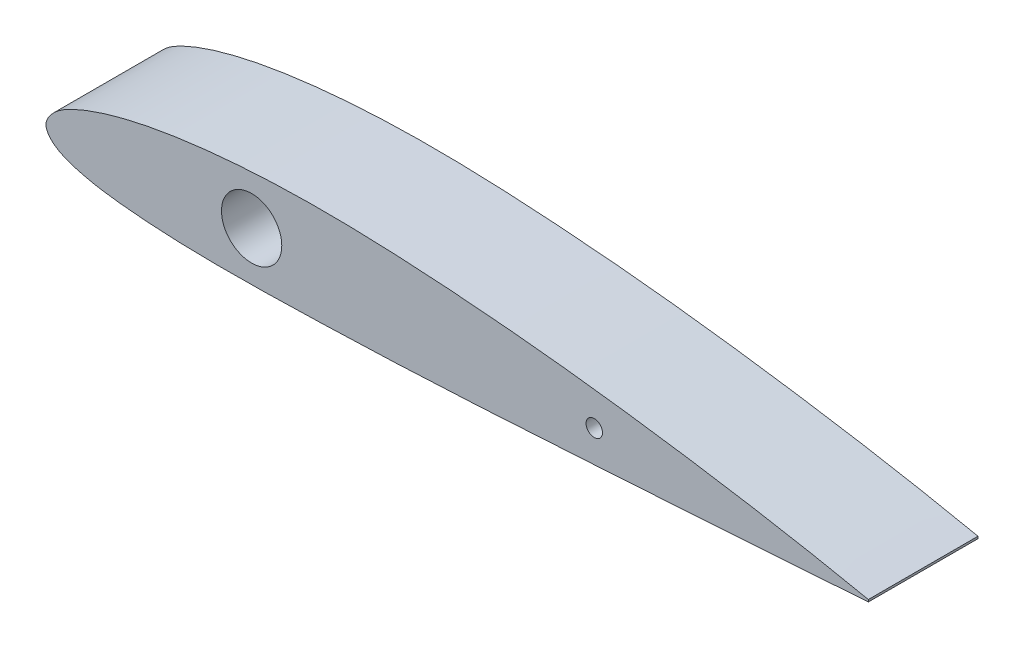
ISO-10303-21;
HEADER;
FILE_DESCRIPTION(('STEP AP214'),'2;1');
FILE_NAME('part.step','',(''),(''),'','','');
FILE_SCHEMA(('AUTOMOTIVE_DESIGN { 1 0 10303 214 1 1 1 1 }'));
ENDSEC;
DATA;
#1=APPLICATION_CONTEXT('core data for automotive mechanical design processes');
#2=APPLICATION_PROTOCOL_DEFINITION('international standard','automotive_design',2000,#1);
#3=PRODUCT_CONTEXT('',#1,'mechanical');
#4=PRODUCT('Part','Part','',(#3));
#5=PRODUCT_RELATED_PRODUCT_CATEGORY('part','',(#4));
#6=PRODUCT_DEFINITION_FORMATION('','',#4);
#7=PRODUCT_DEFINITION_CONTEXT('part definition',#1,'design');
#8=PRODUCT_DEFINITION('design','',#6,#7);
#9=PRODUCT_DEFINITION_SHAPE('','',#8);
#10=(LENGTH_UNIT() NAMED_UNIT(*) SI_UNIT(.MILLI.,.METRE.));
#11=(NAMED_UNIT(*) PLANE_ANGLE_UNIT() SI_UNIT($,.RADIAN.));
#12=(NAMED_UNIT(*) SI_UNIT($,.STERADIAN.) SOLID_ANGLE_UNIT());
#13=UNCERTAINTY_MEASURE_WITH_UNIT(LENGTH_MEASURE(1.E-05),#10,'distance_accuracy_value','');
#14=(GEOMETRIC_REPRESENTATION_CONTEXT(3) GLOBAL_UNCERTAINTY_ASSIGNED_CONTEXT((#13)) GLOBAL_UNIT_ASSIGNED_CONTEXT((#10,
#11,#12)) REPRESENTATION_CONTEXT('',''));
#15=CARTESIAN_POINT('',(0.,0.,0.));
#16=DIRECTION('',(0.,0.,1.));
#17=DIRECTION('',(1.,0.,0.));
#18=AXIS2_PLACEMENT_3D('',#15,#16,#17);
#19=CARTESIAN_POINT('',(369.112706542221,16.1329028596308,52.4952546447813));
#20=DIRECTION('',(0.,0.,1.));
#21=DIRECTION('',(1.,0.,0.));
#22=AXIS2_PLACEMENT_3D('',#19,#20,#21);
#23=CYLINDRICAL_SURFACE('',#22,11.);
#24=CARTESIAN_POINT('',(369.112706542221,16.1329028596308,94.9952546447813));
#25=DIRECTION('',(0.,0.,1.));
#26=DIRECTION('',(1.,0.,0.));
#27=AXIS2_PLACEMENT_3D('',#24,#25,#26);
#28=CIRCLE('',#27,11.);
#29=CARTESIAN_POINT('',(380.112706542221,16.1329028596308,94.9952546447813));
#30=VERTEX_POINT('',#29);
#31=EDGE_CURVE('E70',#30,#30,#28,.F.);
#32=CARTESIAN_POINT('',(369.112706542221,16.1329028596308,54.9952546447813));
#33=DIRECTION('',(0.,0.,-1.));
#34=DIRECTION('',(-1.,0.,0.));
#35=AXIS2_PLACEMENT_3D('',#32,#33,#34);
#36=CIRCLE('',#35,11.);
#37=CARTESIAN_POINT('',(380.112706542221,16.1329028596308,54.9952546447813));
#38=VERTEX_POINT('',#37);
#39=EDGE_CURVE('E41',#38,#38,#36,.F.);
#40=CARTESIAN_POINT('',(380.112706542221,16.1329028596308,94.9952546447813));
#41=CARTESIAN_POINT('',(380.112706542221,16.1329028596308,94.5785879781146));
#42=CARTESIAN_POINT('',(380.112706542221,16.1329028596308,94.1619213114479));
#43=CARTESIAN_POINT('',(380.112706542221,16.1329028596308,93.3285879781146));
#44=CARTESIAN_POINT('',(380.112706542221,16.1329028596308,92.9119213114479));
#45=CARTESIAN_POINT('',(380.112706542221,16.1329028596308,92.0785879781146));
#46=CARTESIAN_POINT('',(380.112706542221,16.1329028596308,91.6619213114479));
#47=CARTESIAN_POINT('',(380.112706542221,16.1329028596308,90.8285879781146));
#48=CARTESIAN_POINT('',(380.112706542221,16.1329028596308,90.4119213114479));
#49=CARTESIAN_POINT('',(380.112706542221,16.1329028596308,89.5785879781146));
#50=CARTESIAN_POINT('',(380.112706542221,16.1329028596308,89.1619213114479));
#51=CARTESIAN_POINT('',(380.112706542221,16.1329028596308,88.3285879781146));
#52=CARTESIAN_POINT('',(380.112706542221,16.1329028596308,87.9119213114479));
#53=CARTESIAN_POINT('',(380.112706542221,16.1329028596308,87.0785879781146));
#54=CARTESIAN_POINT('',(380.112706542221,16.1329028596308,86.6619213114479));
#55=CARTESIAN_POINT('',(380.112706542221,16.1329028596308,85.8285879781146));
#56=CARTESIAN_POINT('',(380.112706542221,16.1329028596308,85.4119213114479));
#57=CARTESIAN_POINT('',(380.112706542221,16.1329028596308,84.5785879781146));
#58=CARTESIAN_POINT('',(380.112706542221,16.1329028596308,84.1619213114479));
#59=CARTESIAN_POINT('',(380.112706542221,16.1329028596308,83.3285879781146));
#60=CARTESIAN_POINT('',(380.112706542221,16.1329028596308,82.9119213114479));
#61=CARTESIAN_POINT('',(380.112706542221,16.1329028596308,82.0785879781146));
#62=CARTESIAN_POINT('',(380.112706542221,16.1329028596308,81.6619213114479));
#63=CARTESIAN_POINT('',(380.112706542221,16.1329028596308,80.8285879781146));
#64=CARTESIAN_POINT('',(380.112706542221,16.1329028596308,80.4119213114479));
#65=CARTESIAN_POINT('',(380.112706542221,16.1329028596308,79.5785879781146));
#66=CARTESIAN_POINT('',(380.112706542221,16.1329028596308,79.1619213114479));
#67=CARTESIAN_POINT('',(380.112706542221,16.1329028596308,78.3285879781146));
#68=CARTESIAN_POINT('',(380.112706542221,16.1329028596308,77.9119213114479));
#69=CARTESIAN_POINT('',(380.112706542221,16.1329028596308,77.0785879781146));
#70=CARTESIAN_POINT('',(380.112706542221,16.1329028596308,76.6619213114479));
#71=CARTESIAN_POINT('',(380.112706542221,16.1329028596308,75.8285879781146));
#72=CARTESIAN_POINT('',(380.112706542221,16.1329028596308,75.4119213114479));
#73=CARTESIAN_POINT('',(380.112706542221,16.1329028596308,74.5785879781146));
#74=CARTESIAN_POINT('',(380.112706542221,16.1329028596308,74.1619213114479));
#75=CARTESIAN_POINT('',(380.112706542221,16.1329028596308,73.3285879781146));
#76=CARTESIAN_POINT('',(380.112706542221,16.1329028596308,72.9119213114479));
#77=CARTESIAN_POINT('',(380.112706542221,16.1329028596308,72.0785879781146));
#78=CARTESIAN_POINT('',(380.112706542221,16.1329028596308,71.6619213114479));
#79=CARTESIAN_POINT('',(380.112706542221,16.1329028596308,70.8285879781146));
#80=CARTESIAN_POINT('',(380.112706542221,16.1329028596308,70.4119213114479));
#81=CARTESIAN_POINT('',(380.112706542221,16.1329028596308,69.5785879781146));
#82=CARTESIAN_POINT('',(380.112706542221,16.1329028596308,69.1619213114479));
#83=CARTESIAN_POINT('',(380.112706542221,16.1329028596308,68.3285879781146));
#84=CARTESIAN_POINT('',(380.112706542221,16.1329028596308,67.9119213114479));
#85=CARTESIAN_POINT('',(380.112706542221,16.1329028596308,67.0785879781146));
#86=CARTESIAN_POINT('',(380.112706542221,16.1329028596308,66.6619213114479));
#87=CARTESIAN_POINT('',(380.112706542221,16.1329028596308,65.8285879781146));
#88=CARTESIAN_POINT('',(380.112706542221,16.1329028596308,65.4119213114479));
#89=CARTESIAN_POINT('',(380.112706542221,16.1329028596308,64.5785879781146));
#90=CARTESIAN_POINT('',(380.112706542221,16.1329028596308,64.1619213114479));
#91=CARTESIAN_POINT('',(380.112706542221,16.1329028596308,63.3285879781146));
#92=CARTESIAN_POINT('',(380.112706542221,16.1329028596308,62.9119213114479));
#93=CARTESIAN_POINT('',(380.112706542221,16.1329028596308,62.0785879781146));
#94=CARTESIAN_POINT('',(380.112706542221,16.1329028596308,61.6619213114479));
#95=CARTESIAN_POINT('',(380.112706542221,16.1329028596308,60.8285879781146));
#96=CARTESIAN_POINT('',(380.112706542221,16.1329028596308,60.4119213114479));
#97=CARTESIAN_POINT('',(380.112706542221,16.1329028596308,59.5785879781146));
#98=CARTESIAN_POINT('',(380.112706542221,16.1329028596308,59.1619213114479));
#99=CARTESIAN_POINT('',(380.112706542221,16.1329028596308,58.3285879781146));
#100=CARTESIAN_POINT('',(380.112706542221,16.1329028596308,57.9119213114479));
#101=CARTESIAN_POINT('',(380.112706542221,16.1329028596308,57.0785879781146));
#102=CARTESIAN_POINT('',(380.112706542221,16.1329028596308,56.6619213114479));
#103=CARTESIAN_POINT('',(380.112706542221,16.1329028596308,55.8285879781146));
#104=CARTESIAN_POINT('',(380.112706542221,16.1329028596308,55.4119213114479));
#105=CARTESIAN_POINT('',(380.112706542221,16.1329028596308,54.9952546447813));
#106=B_SPLINE_CURVE_WITH_KNOTS('',3,(#40,#41,#42,#43,#44,#45,#46,#47,#48,#49,#50,#51,#52,#53,
#54,#55,#56,#57,#58,#59,#60,#61,#62,#63,#64,#65,#66,#67,#68,#69,#70,#71,#72,#73,#74,#75,#76,#77,
#78,#79,#80,#81,#82,#83,#84,#85,#86,#87,#88,#89,#90,#91,#92,#93,#94,#95,#96,#97,#98,#99,#100,
#101,#102,#103,#104,#105),.UNSPECIFIED.,.F.,.F.,(4,2,2,2,2,2,2,2,2,2,2,2,2,2,2,2,2,2,2,2,2,2,2,
2,2,2,2,2,2,2,2,2,4),(0.,1.25,2.5,3.75,5.,6.25000000000001,7.50000000000001,8.75000000000001,
10.,11.25,12.5,13.75,15.,16.25,17.5,18.75,20.,21.25,22.5,23.75,25.,26.25,27.5,28.75,30.,31.25,
32.5,33.75,35.,36.25,37.5,38.75,40.),.UNSPECIFIED.);
#107=EDGE_CURVE('BSEAM36',#30,#38,#106,.T.);
#108=ORIENTED_EDGE('',*,*,#31,.F.);
#109=ORIENTED_EDGE('',*,*,#39,.F.);
#110=ORIENTED_EDGE('',*,*,#107,.T.);
#111=ORIENTED_EDGE('',*,*,#107,.F.);
#112=EDGE_LOOP('',(#108,#110,#109,#111));
#113=FACE_BOUND('',#112,.T.);
#114=ADVANCED_FACE('F36',(#113),#23,.F.);
#115=CARTESIAN_POINT('',(293.778586498227,-17.7412373470501,94.9952546447813));
#116=DIRECTION('',(0.,0.,1.));
#117=DIRECTION('',(1.,0.,0.));
#118=AXIS2_PLACEMENT_3D('',#115,#116,#117);
#119=PLANE('',#118);
#120=CARTESIAN_POINT('',(494.112706542216,15.5042254871234,94.9952546447813));
#121=DIRECTION('',(0.,0.,1.));
#122=DIRECTION('',(1.,0.,0.));
#123=AXIS2_PLACEMENT_3D('',#120,#121,#122);
#124=CIRCLE('',#123,3.00000000000005);
#125=CARTESIAN_POINT('',(497.112706542216,15.5042254871234,94.9952546447813));
#126=VERTEX_POINT('',#125);
#127=EDGE_CURVE('E75',#126,#126,#124,.F.);
#128=ORIENTED_EDGE('',*,*,#127,.T.);
#129=EDGE_LOOP('',(#128));
#130=FACE_BOUND('',#129,.T.);
#131=ORIENTED_EDGE('',*,*,#31,.T.);
#132=EDGE_LOOP('',(#131));
#133=FACE_BOUND('',#132,.T.);
#134=CARTESIAN_POINT('',(594.112706542216,11.3312197601064,94.9952546447813));
#135=CARTESIAN_POINT('',(583.53072626726,13.5436667811095,94.9952546447813));
#136=CARTESIAN_POINT('',(567.156143855169,16.7289820168753,94.9952546447813));
#137=CARTESIAN_POINT('',(545.794442186332,20.3665563736611,94.9952546447813));
#138=CARTESIAN_POINT('',(528.052940062616,23.1554378159101,94.9952546447813));
#139=CARTESIAN_POINT('',(510.392352797769,25.6888128941034,94.9952546447813));
#140=CARTESIAN_POINT('',(491.275375732607,28.146823796216,94.9952546447813));
#141=CARTESIAN_POINT('',(472.714254910155,30.2320752244368,94.9952546447813));
#142=CARTESIAN_POINT('',(451.870556250504,32.1371081749344,94.9952546447813));
#143=CARTESIAN_POINT('',(431.653348278847,33.5811733725847,94.9952546447813));
#144=CARTESIAN_POINT('',(412.22806311401,34.4851824560265,94.9952546447813));
#145=CARTESIAN_POINT('',(393.824942594471,34.8281665082507,94.9952546447813));
#146=CARTESIAN_POINT('',(377.32130001837,34.4802166355402,94.9952546447813));
#147=CARTESIAN_POINT('',(359.597149564384,33.3712034095177,94.9952546447813));
#148=CARTESIAN_POINT('',(344.352184205621,31.7334825806711,94.9952546447813));
#149=CARTESIAN_POINT('',(327.8029391296,28.8762010066723,94.9952546447813));
#150=CARTESIAN_POINT('',(315.008860604811,25.609668265327,94.9952546447813));
#151=CARTESIAN_POINT('',(305.189162836082,21.87910849007,94.9952546447813));
#152=CARTESIAN_POINT('',(299.880935104512,19.0438224156505,94.9952546447813));
#153=CARTESIAN_POINT('',(297.186490358361,16.8671552641287,94.9952546447813));
#154=CARTESIAN_POINT('',(295.737890552129,15.3038584840006,94.9952546447813));
#155=CARTESIAN_POINT('',(294.480860882108,13.4240643808711,94.9952546447813));
#156=CARTESIAN_POINT('',(293.778586498227,11.1391900008965,94.9952546447813));
#157=CARTESIAN_POINT('',(294.955257903388,8.47088402302274,94.9952546447813));
#158=CARTESIAN_POINT('',(297.163887845587,6.29900268076822,94.9952546447813));
#159=CARTESIAN_POINT('',(300.896088753035,4.22990540485052,94.9952546447813));
#160=CARTESIAN_POINT('',(305.892139419476,2.64605059617665,94.9952546447813));
#161=CARTESIAN_POINT('',(313.122029572872,0.962391994688039,94.9952546447813));
#162=CARTESIAN_POINT('',(323.002994799618,-0.296983688709277,94.9952546447813));
#163=CARTESIAN_POINT('',(336.454998862129,-1.34878046154009,94.9952546447813));
#164=CARTESIAN_POINT('',(360.334464667836,-2.05693352910309,94.9952546447813));
#165=CARTESIAN_POINT('',(388.928917254227,-1.35816080112511,94.9952546447813));
#166=CARTESIAN_POINT('',(422.818649481183,-0.183793823056776,94.9952546447813));
#167=CARTESIAN_POINT('',(454.112223374519,1.40892102903302,94.9952546447813));
#168=CARTESIAN_POINT('',(487.323022286463,3.47745174999101,94.9952546447813));
#169=CARTESIAN_POINT('',(534.102183139981,6.36550695258043,94.9952546447813));
#170=CARTESIAN_POINT('',(569.641572795999,8.87507271675326,94.9952546447813));
#171=CARTESIAN_POINT('',(594.112706542217,10.5512197601064,94.9952546447813));
#172=B_SPLINE_CURVE_WITH_KNOTS('',3,(#134,#135,#136,#137,#138,#139,#140,#141,#142,#143,#144,
#145,#146,#147,#148,#149,#150,#151,#152,#153,#154,#155,#156,#157,#158,#159,#160,#161,#162,#163,
#164,#165,#166,#167,#168,#169,#170,#171),.UNSPECIFIED.,.F.,.F.,(4,1,1,1,1,1,1,1,1,1,1,1,1,1,1,1,
1,1,1,1,1,1,1,1,1,1,1,1,1,1,1,1,1,1,1,4),(0.,0.0529779391463818,0.0817376929006654,
0.106185234973789,0.140986133995364,0.169165020792293,0.200636479193825,0.232510831816365,
0.271729305578374,0.299952701904087,0.327797668599622,0.361916964403109,0.380808038678929,
0.41481836461567,0.436985824410233,0.463079119766163,0.47936862310597,0.488396004965109,
0.492389735137145,0.496304197310246,0.49876184562352,0.503522343620652,0.507143868904807,
0.512430572383014,0.518483882496799,0.527880831347698,0.538020027147716,0.554844217138109,
0.576615116920705,0.604140075436629,0.671866348914674,0.71673244156722,0.770323553556591,
0.825408654056714,0.879797678944328,1.),.UNSPECIFIED.);
#173=CARTESIAN_POINT('',(594.112706542216,11.3312197601064,94.9952546447813));
#174=VERTEX_POINT('',#173);
#175=CARTESIAN_POINT('',(594.112706542216,10.5512197601064,94.9952546447813));
#176=VERTEX_POINT('',#175);
#177=EDGE_CURVE('E53',#174,#176,#172,.T.);
#178=ORIENTED_EDGE('',*,*,#177,.T.);
#179=DIRECTION('',(0.,-1.,0.));
#180=VECTOR('',#179,1.);
#181=CARTESIAN_POINT('',(594.112706542216,-17.7412373470501,94.9952546447813));
#182=LINE('',#181,#180);
#183=EDGE_CURVE('E65',#174,#176,#182,.T.);
#184=ORIENTED_EDGE('',*,*,#183,.F.);
#185=EDGE_LOOP('',(#178,#184));
#186=FACE_BOUND('',#185,.T.);
#187=ADVANCED_FACE('F66',(#130,#133,#186),#119,.T.);
#188=CARTESIAN_POINT('',(293.778586498227,-17.7412373470501,54.9952546447813));
#189=DIRECTION('',(0.,0.,-1.));
#190=DIRECTION('',(-1.,0.,0.));
#191=AXIS2_PLACEMENT_3D('',#188,#189,#190);
#192=PLANE('',#191);
#193=CARTESIAN_POINT('',(494.112706542216,15.5042254871234,54.9952546447813));
#194=DIRECTION('',(0.,0.,-1.));
#195=DIRECTION('',(-1.,0.,0.));
#196=AXIS2_PLACEMENT_3D('',#193,#194,#195);
#197=CIRCLE('',#196,3.00000000000005);
#198=CARTESIAN_POINT('',(497.112706542216,15.5042254871234,54.9952546447813));
#199=VERTEX_POINT('',#198);
#200=EDGE_CURVE('E79',#199,#199,#197,.F.);
#201=ORIENTED_EDGE('',*,*,#200,.T.);
#202=EDGE_LOOP('',(#201));
#203=FACE_BOUND('',#202,.T.);
#204=ORIENTED_EDGE('',*,*,#39,.T.);
#205=EDGE_LOOP('',(#204));
#206=FACE_BOUND('',#205,.T.);
#207=CARTESIAN_POINT('',(594.112706542216,11.3312197601064,54.9952546447813));
#208=CARTESIAN_POINT('',(583.53072626726,13.5436667811095,54.9952546447813));
#209=CARTESIAN_POINT('',(567.156143855169,16.7289820168753,54.9952546447813));
#210=CARTESIAN_POINT('',(545.794442186332,20.3665563736611,54.9952546447813));
#211=CARTESIAN_POINT('',(528.052940062616,23.1554378159101,54.9952546447813));
#212=CARTESIAN_POINT('',(510.392352797769,25.6888128941034,54.9952546447813));
#213=CARTESIAN_POINT('',(491.275375732607,28.146823796216,54.9952546447813));
#214=CARTESIAN_POINT('',(472.714254910155,30.2320752244368,54.9952546447813));
#215=CARTESIAN_POINT('',(451.870556250504,32.1371081749344,54.9952546447813));
#216=CARTESIAN_POINT('',(431.653348278847,33.5811733725847,54.9952546447813));
#217=CARTESIAN_POINT('',(412.22806311401,34.4851824560265,54.9952546447813));
#218=CARTESIAN_POINT('',(393.824942594471,34.8281665082507,54.9952546447813));
#219=CARTESIAN_POINT('',(377.32130001837,34.4802166355402,54.9952546447813));
#220=CARTESIAN_POINT('',(359.597149564384,33.3712034095177,54.9952546447813));
#221=CARTESIAN_POINT('',(344.352184205621,31.7334825806711,54.9952546447813));
#222=CARTESIAN_POINT('',(327.8029391296,28.8762010066723,54.9952546447813));
#223=CARTESIAN_POINT('',(315.008860604811,25.609668265327,54.9952546447813));
#224=CARTESIAN_POINT('',(305.189162836082,21.87910849007,54.9952546447813));
#225=CARTESIAN_POINT('',(299.880935104512,19.0438224156505,54.9952546447813));
#226=CARTESIAN_POINT('',(297.186490358361,16.8671552641287,54.9952546447813));
#227=CARTESIAN_POINT('',(295.737890552129,15.3038584840006,54.9952546447813));
#228=CARTESIAN_POINT('',(294.480860882108,13.4240643808711,54.9952546447813));
#229=CARTESIAN_POINT('',(293.778586498227,11.1391900008965,54.9952546447813));
#230=CARTESIAN_POINT('',(294.955257903388,8.47088402302274,54.9952546447813));
#231=CARTESIAN_POINT('',(297.163887845587,6.29900268076822,54.9952546447813));
#232=CARTESIAN_POINT('',(300.896088753035,4.22990540485052,54.9952546447813));
#233=CARTESIAN_POINT('',(305.892139419476,2.64605059617665,54.9952546447813));
#234=CARTESIAN_POINT('',(313.122029572872,0.962391994688039,54.9952546447813));
#235=CARTESIAN_POINT('',(323.002994799618,-0.296983688709277,54.9952546447813));
#236=CARTESIAN_POINT('',(336.454998862129,-1.34878046154009,54.9952546447813));
#237=CARTESIAN_POINT('',(360.334464667836,-2.05693352910309,54.9952546447813));
#238=CARTESIAN_POINT('',(388.928917254227,-1.35816080112511,54.9952546447813));
#239=CARTESIAN_POINT('',(422.818649481183,-0.183793823056776,54.9952546447813));
#240=CARTESIAN_POINT('',(454.112223374519,1.40892102903302,54.9952546447813));
#241=CARTESIAN_POINT('',(487.323022286463,3.47745174999101,54.9952546447813));
#242=CARTESIAN_POINT('',(534.102183139981,6.36550695258043,54.9952546447813));
#243=CARTESIAN_POINT('',(569.641572795999,8.87507271675326,54.9952546447813));
#244=CARTESIAN_POINT('',(594.112706542217,10.5512197601064,54.9952546447813));
#245=B_SPLINE_CURVE_WITH_KNOTS('',3,(#207,#208,#209,#210,#211,#212,#213,#214,#215,#216,#217,
#218,#219,#220,#221,#222,#223,#224,#225,#226,#227,#228,#229,#230,#231,#232,#233,#234,#235,#236,
#237,#238,#239,#240,#241,#242,#243,#244),.UNSPECIFIED.,.F.,.F.,(4,1,1,1,1,1,1,1,1,1,1,1,1,1,1,1,
1,1,1,1,1,1,1,1,1,1,1,1,1,1,1,1,1,1,1,4),(0.,0.0529779391463818,0.0817376929006654,
0.106185234973789,0.140986133995364,0.169165020792293,0.200636479193825,0.232510831816365,
0.271729305578374,0.299952701904087,0.327797668599622,0.361916964403109,0.380808038678929,
0.41481836461567,0.436985824410233,0.463079119766163,0.47936862310597,0.488396004965109,
0.492389735137145,0.496304197310246,0.49876184562352,0.503522343620652,0.507143868904807,
0.512430572383014,0.518483882496799,0.527880831347698,0.538020027147716,0.554844217138109,
0.576615116920705,0.604140075436629,0.671866348914674,0.71673244156722,0.770323553556591,
0.825408654056714,0.879797678944328,1.),.UNSPECIFIED.);
#246=CARTESIAN_POINT('',(594.112706542216,10.5512197601064,54.9952546447813));
#247=VERTEX_POINT('',#246);
#248=CARTESIAN_POINT('',(594.112706542216,11.3312197601064,54.9952546447813));
#249=VERTEX_POINT('',#248);
#250=EDGE_CURVE('E60',#247,#249,#245,.F.);
#251=ORIENTED_EDGE('',*,*,#250,.T.);
#252=DIRECTION('',(0.,1.,0.));
#253=VECTOR('',#252,1.);
#254=CARTESIAN_POINT('',(594.112706542216,-17.7412373470501,54.9952546447813));
#255=LINE('',#254,#253);
#256=EDGE_CURVE('E71',#247,#249,#255,.T.);
#257=ORIENTED_EDGE('',*,*,#256,.F.);
#258=EDGE_LOOP('',(#251,#257));
#259=FACE_BOUND('',#258,.T.);
#260=ADVANCED_FACE('F109',(#203,#206,#259),#192,.T.);
#261=CARTESIAN_POINT('',(494.112706542216,15.5042254871234,52.4952546447813));
#262=DIRECTION('',(0.,0.,1.));
#263=DIRECTION('',(1.,0.,0.));
#264=AXIS2_PLACEMENT_3D('',#261,#262,#263);
#265=CYLINDRICAL_SURFACE('',#264,3.00000000000005);
#266=CARTESIAN_POINT('',(497.112706542216,15.5042254871234,94.9952546447813));
#267=CARTESIAN_POINT('',(497.112706542216,15.5042254871234,94.5785879781146));
#268=CARTESIAN_POINT('',(497.112706542216,15.5042254871234,94.1619213114479));
#269=CARTESIAN_POINT('',(497.112706542216,15.5042254871234,93.3285879781146));
#270=CARTESIAN_POINT('',(497.112706542216,15.5042254871234,92.9119213114479));
#271=CARTESIAN_POINT('',(497.112706542216,15.5042254871234,92.0785879781146));
#272=CARTESIAN_POINT('',(497.112706542216,15.5042254871234,91.6619213114479));
#273=CARTESIAN_POINT('',(497.112706542216,15.5042254871234,90.8285879781146));
#274=CARTESIAN_POINT('',(497.112706542216,15.5042254871234,90.4119213114479));
#275=CARTESIAN_POINT('',(497.112706542216,15.5042254871234,89.5785879781146));
#276=CARTESIAN_POINT('',(497.112706542216,15.5042254871234,89.1619213114479));
#277=CARTESIAN_POINT('',(497.112706542216,15.5042254871234,88.3285879781146));
#278=CARTESIAN_POINT('',(497.112706542216,15.5042254871234,87.9119213114479));
#279=CARTESIAN_POINT('',(497.112706542216,15.5042254871234,87.0785879781146));
#280=CARTESIAN_POINT('',(497.112706542216,15.5042254871234,86.6619213114479));
#281=CARTESIAN_POINT('',(497.112706542216,15.5042254871234,85.8285879781146));
#282=CARTESIAN_POINT('',(497.112706542216,15.5042254871234,85.4119213114479));
#283=CARTESIAN_POINT('',(497.112706542216,15.5042254871234,84.5785879781146));
#284=CARTESIAN_POINT('',(497.112706542216,15.5042254871234,84.1619213114479));
#285=CARTESIAN_POINT('',(497.112706542216,15.5042254871234,83.3285879781146));
#286=CARTESIAN_POINT('',(497.112706542216,15.5042254871234,82.9119213114479));
#287=CARTESIAN_POINT('',(497.112706542216,15.5042254871234,82.0785879781146));
#288=CARTESIAN_POINT('',(497.112706542216,15.5042254871234,81.6619213114479));
#289=CARTESIAN_POINT('',(497.112706542216,15.5042254871234,80.8285879781146));
#290=CARTESIAN_POINT('',(497.112706542216,15.5042254871234,80.4119213114479));
#291=CARTESIAN_POINT('',(497.112706542216,15.5042254871234,79.5785879781146));
#292=CARTESIAN_POINT('',(497.112706542216,15.5042254871234,79.1619213114479));
#293=CARTESIAN_POINT('',(497.112706542216,15.5042254871234,78.3285879781146));
#294=CARTESIAN_POINT('',(497.112706542216,15.5042254871234,77.9119213114479));
#295=CARTESIAN_POINT('',(497.112706542216,15.5042254871234,77.0785879781146));
#296=CARTESIAN_POINT('',(497.112706542216,15.5042254871234,76.6619213114479));
#297=CARTESIAN_POINT('',(497.112706542216,15.5042254871234,75.8285879781146));
#298=CARTESIAN_POINT('',(497.112706542216,15.5042254871234,75.4119213114479));
#299=CARTESIAN_POINT('',(497.112706542216,15.5042254871234,74.5785879781146));
#300=CARTESIAN_POINT('',(497.112706542216,15.5042254871234,74.1619213114479));
#301=CARTESIAN_POINT('',(497.112706542216,15.5042254871234,73.3285879781146));
#302=CARTESIAN_POINT('',(497.112706542216,15.5042254871234,72.9119213114479));
#303=CARTESIAN_POINT('',(497.112706542216,15.5042254871234,72.0785879781146));
#304=CARTESIAN_POINT('',(497.112706542216,15.5042254871234,71.6619213114479));
#305=CARTESIAN_POINT('',(497.112706542216,15.5042254871234,70.8285879781146));
#306=CARTESIAN_POINT('',(497.112706542216,15.5042254871234,70.4119213114479));
#307=CARTESIAN_POINT('',(497.112706542216,15.5042254871234,69.5785879781146));
#308=CARTESIAN_POINT('',(497.112706542216,15.5042254871234,69.1619213114479));
#309=CARTESIAN_POINT('',(497.112706542216,15.5042254871234,68.3285879781146));
#310=CARTESIAN_POINT('',(497.112706542216,15.5042254871234,67.9119213114479));
#311=CARTESIAN_POINT('',(497.112706542216,15.5042254871234,67.0785879781146));
#312=CARTESIAN_POINT('',(497.112706542216,15.5042254871234,66.6619213114479));
#313=CARTESIAN_POINT('',(497.112706542216,15.5042254871234,65.8285879781146));
#314=CARTESIAN_POINT('',(497.112706542216,15.5042254871234,65.4119213114479));
#315=CARTESIAN_POINT('',(497.112706542216,15.5042254871234,64.5785879781146));
#316=CARTESIAN_POINT('',(497.112706542216,15.5042254871234,64.1619213114479));
#317=CARTESIAN_POINT('',(497.112706542216,15.5042254871234,63.3285879781146));
#318=CARTESIAN_POINT('',(497.112706542216,15.5042254871234,62.9119213114479));
#319=CARTESIAN_POINT('',(497.112706542216,15.5042254871234,62.0785879781146));
#320=CARTESIAN_POINT('',(497.112706542216,15.5042254871234,61.6619213114479));
#321=CARTESIAN_POINT('',(497.112706542216,15.5042254871234,60.8285879781146));
#322=CARTESIAN_POINT('',(497.112706542216,15.5042254871234,60.4119213114479));
#323=CARTESIAN_POINT('',(497.112706542216,15.5042254871234,59.5785879781146));
#324=CARTESIAN_POINT('',(497.112706542216,15.5042254871234,59.1619213114479));
#325=CARTESIAN_POINT('',(497.112706542216,15.5042254871234,58.3285879781146));
#326=CARTESIAN_POINT('',(497.112706542216,15.5042254871234,57.9119213114479));
#327=CARTESIAN_POINT('',(497.112706542216,15.5042254871234,57.0785879781146));
#328=CARTESIAN_POINT('',(497.112706542216,15.5042254871234,56.6619213114479));
#329=CARTESIAN_POINT('',(497.112706542216,15.5042254871234,55.8285879781146));
#330=CARTESIAN_POINT('',(497.112706542216,15.5042254871234,55.4119213114479));
#331=CARTESIAN_POINT('',(497.112706542216,15.5042254871234,54.9952546447813));
#332=B_SPLINE_CURVE_WITH_KNOTS('',3,(#266,#267,#268,#269,#270,#271,#272,#273,#274,#275,#276,
#277,#278,#279,#280,#281,#282,#283,#284,#285,#286,#287,#288,#289,#290,#291,#292,#293,#294,#295,
#296,#297,#298,#299,#300,#301,#302,#303,#304,#305,#306,#307,#308,#309,#310,#311,#312,#313,#314,
#315,#316,#317,#318,#319,#320,#321,#322,#323,#324,#325,#326,#327,#328,#329,#330,#331),
.UNSPECIFIED.,.F.,.F.,(4,2,2,2,2,2,2,2,2,2,2,2,2,2,2,2,2,2,2,2,2,2,2,2,2,2,2,2,2,2,2,2,4),(0.,
1.25,2.5,3.75,5.,6.25000000000001,7.50000000000001,8.75000000000001,10.,11.25,12.5,13.75,15.,
16.25,17.5,18.75,20.,21.25,22.5,23.75,25.,26.25,27.5,28.75,30.,31.25,32.5,33.75,35.,36.25,37.5,
38.75,40.),.UNSPECIFIED.);
#333=EDGE_CURVE('BSEAM120',#126,#199,#332,.T.);
#334=ORIENTED_EDGE('',*,*,#127,.F.);
#335=ORIENTED_EDGE('',*,*,#200,.F.);
#336=ORIENTED_EDGE('',*,*,#333,.T.);
#337=ORIENTED_EDGE('',*,*,#333,.F.);
#338=EDGE_LOOP('',(#334,#336,#335,#337));
#339=FACE_BOUND('',#338,.T.);
#340=ADVANCED_FACE('F120',(#339),#265,.F.);
#341=CARTESIAN_POINT('',(594.112706542216,11.3312197601064,97.4952546447813));
#342=CARTESIAN_POINT('',(583.53072626726,13.5436667811095,97.4952546447813));
#343=CARTESIAN_POINT('',(567.156143855169,16.7289820168753,97.4952546447813));
#344=CARTESIAN_POINT('',(545.794442186332,20.3665563736611,97.4952546447813));
#345=CARTESIAN_POINT('',(528.052940062616,23.1554378159101,97.4952546447813));
#346=CARTESIAN_POINT('',(510.392352797769,25.6888128941034,97.4952546447813));
#347=CARTESIAN_POINT('',(491.275375732607,28.146823796216,97.4952546447813));
#348=CARTESIAN_POINT('',(472.714254910155,30.2320752244368,97.4952546447813));
#349=CARTESIAN_POINT('',(451.870556250504,32.1371081749344,97.4952546447813));
#350=CARTESIAN_POINT('',(431.653348278847,33.5811733725847,97.4952546447813));
#351=CARTESIAN_POINT('',(412.22806311401,34.4851824560265,97.4952546447813));
#352=CARTESIAN_POINT('',(393.824942594471,34.8281665082507,97.4952546447813));
#353=CARTESIAN_POINT('',(377.32130001837,34.4802166355402,97.4952546447813));
#354=CARTESIAN_POINT('',(359.597149564384,33.3712034095177,97.4952546447813));
#355=CARTESIAN_POINT('',(344.352184205621,31.7334825806711,97.4952546447813));
#356=CARTESIAN_POINT('',(327.8029391296,28.8762010066723,97.4952546447813));
#357=CARTESIAN_POINT('',(315.008860604811,25.609668265327,97.4952546447813));
#358=CARTESIAN_POINT('',(305.189162836082,21.87910849007,97.4952546447813));
#359=CARTESIAN_POINT('',(299.880935104512,19.0438224156505,97.4952546447813));
#360=CARTESIAN_POINT('',(297.186490358361,16.8671552641287,97.4952546447813));
#361=CARTESIAN_POINT('',(295.737890552129,15.3038584840006,97.4952546447813));
#362=CARTESIAN_POINT('',(294.480860882108,13.4240643808711,97.4952546447813));
#363=CARTESIAN_POINT('',(293.778586498227,11.1391900008965,97.4952546447813));
#364=CARTESIAN_POINT('',(294.955257903388,8.47088402302274,97.4952546447813));
#365=CARTESIAN_POINT('',(297.163887845587,6.29900268076822,97.4952546447813));
#366=CARTESIAN_POINT('',(300.896088753035,4.22990540485052,97.4952546447813));
#367=CARTESIAN_POINT('',(305.892139419476,2.64605059617665,97.4952546447813));
#368=CARTESIAN_POINT('',(313.122029572872,0.962391994688039,97.4952546447813));
#369=CARTESIAN_POINT('',(323.002994799618,-0.296983688709277,97.4952546447813));
#370=CARTESIAN_POINT('',(336.454998862129,-1.34878046154009,97.4952546447813));
#371=CARTESIAN_POINT('',(360.334464667836,-2.05693352910309,97.4952546447813));
#372=CARTESIAN_POINT('',(388.928917254227,-1.35816080112511,97.4952546447813));
#373=CARTESIAN_POINT('',(422.818649481183,-0.183793823056776,97.4952546447813));
#374=CARTESIAN_POINT('',(454.112223374519,1.40892102903302,97.4952546447813));
#375=CARTESIAN_POINT('',(487.323022286463,3.47745174999101,97.4952546447813));
#376=CARTESIAN_POINT('',(534.102183139981,6.36550695258043,97.4952546447813));
#377=CARTESIAN_POINT('',(569.641572795999,8.87507271675326,97.4952546447813));
#378=CARTESIAN_POINT('',(594.112706542217,10.5512197601064,97.4952546447813));
#379=B_SPLINE_CURVE_WITH_KNOTS('',3,(#341,#342,#343,#344,#345,#346,#347,#348,#349,#350,#351,
#352,#353,#354,#355,#356,#357,#358,#359,#360,#361,#362,#363,#364,#365,#366,#367,#368,#369,#370,
#371,#372,#373,#374,#375,#376,#377,#378),.UNSPECIFIED.,.F.,.F.,(4,1,1,1,1,1,1,1,1,1,1,1,1,1,1,1,
1,1,1,1,1,1,1,1,1,1,1,1,1,1,1,1,1,1,1,4),(0.,0.0529779391463818,0.0817376929006654,
0.106185234973789,0.140986133995364,0.169165020792293,0.200636479193825,0.232510831816365,
0.271729305578374,0.299952701904087,0.327797668599622,0.361916964403109,0.380808038678929,
0.41481836461567,0.436985824410233,0.463079119766163,0.47936862310597,0.488396004965109,
0.492389735137145,0.496304197310246,0.49876184562352,0.503522343620652,0.507143868904807,
0.512430572383014,0.518483882496799,0.527880831347698,0.538020027147716,0.554844217138109,
0.576615116920705,0.604140075436629,0.671866348914674,0.71673244156722,0.770323553556591,
0.825408654056714,0.879797678944328,1.),.UNSPECIFIED.);
#380=DIRECTION('',(0.,0.,-1.));
#381=VECTOR('',#380,1.);
#382=SURFACE_OF_LINEAR_EXTRUSION('',#379,#381);
#383=ORIENTED_EDGE('',*,*,#250,.F.);
#384=DIRECTION('',(0.,0.,-1.));
#385=VECTOR('',#384,1.);
#386=CARTESIAN_POINT('',(594.112706542216,10.5512197601064,97.4952546447813));
#387=LINE('',#386,#385);
#388=EDGE_CURVE('E12',#176,#247,#387,.T.);
#389=ORIENTED_EDGE('',*,*,#388,.F.);
#390=ORIENTED_EDGE('',*,*,#177,.F.);
#391=DIRECTION('',(0.,0.,-1.));
#392=VECTOR('',#391,1.);
#393=CARTESIAN_POINT('',(594.112706542216,11.3312197601064,97.4952546447813));
#394=LINE('',#393,#392);
#395=EDGE_CURVE('E46',#174,#249,#394,.T.);
#396=ORIENTED_EDGE('',*,*,#395,.T.);
#397=EDGE_LOOP('',(#383,#389,#390,#396));
#398=FACE_BOUND('',#397,.T.);
#399=ADVANCED_FACE('F38',(#398),#382,.F.);
#400=CARTESIAN_POINT('',(594.112706542216,11.3312197601064,97.4952546447813));
#401=DIRECTION('',(-1.,0.,0.));
#402=DIRECTION('',(0.,0.,1.));
#403=AXIS2_PLACEMENT_3D('',#400,#401,#402);
#404=PLANE('',#403);
#405=ORIENTED_EDGE('',*,*,#256,.T.);
#406=ORIENTED_EDGE('',*,*,#395,.F.);
#407=ORIENTED_EDGE('',*,*,#183,.T.);
#408=ORIENTED_EDGE('',*,*,#388,.T.);
#409=EDGE_LOOP('',(#405,#406,#407,#408));
#410=FACE_BOUND('',#409,.T.);
#411=ADVANCED_FACE('F77',(#410),#404,.F.);
#412=CLOSED_SHELL('',(#114,#187,#260,#340,#399,#411));
#413=MANIFOLD_SOLID_BREP('B2',#412);
#414=ADVANCED_BREP_SHAPE_REPRESENTATION('',(#18,#413),#14);
#415=SHAPE_DEFINITION_REPRESENTATION(#9,#414);
ENDSEC;
END-ISO-10303-21;
